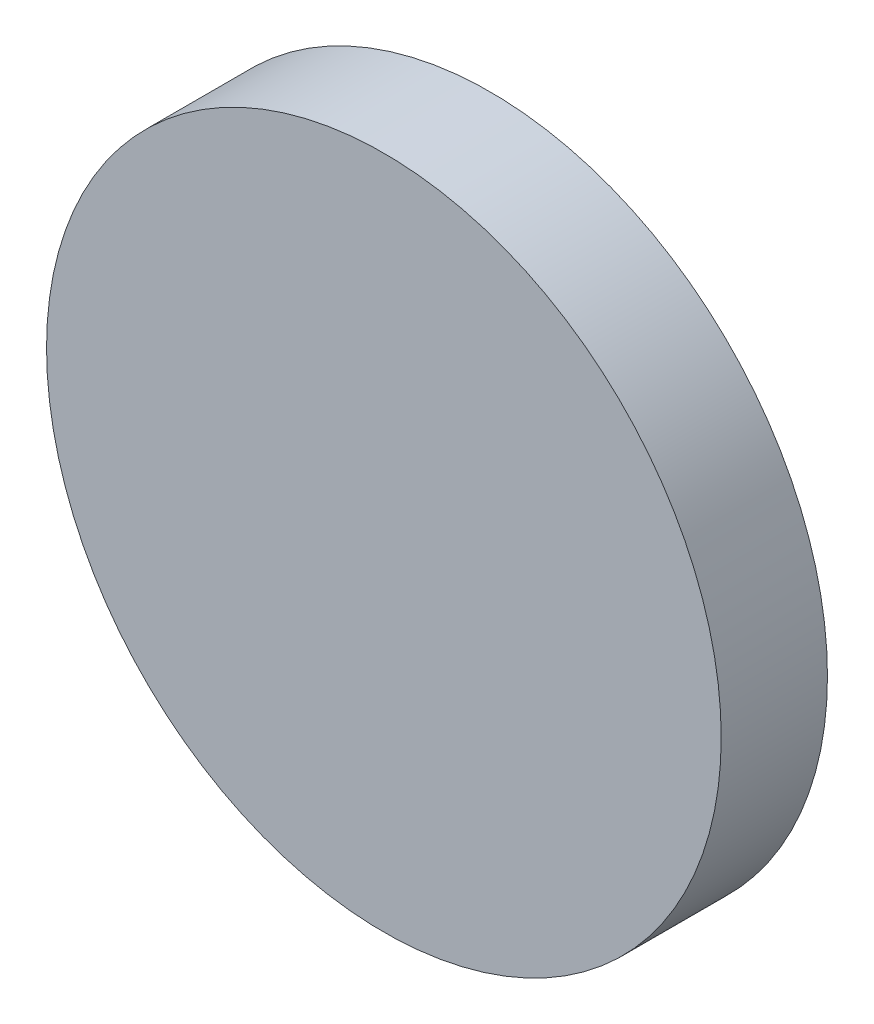
ISO-10303-21;
HEADER;
FILE_DESCRIPTION(('STEP AP214'),'2;1');
FILE_NAME('part.step','',(''),(''),'','','');
FILE_SCHEMA(('AUTOMOTIVE_DESIGN { 1 0 10303 214 1 1 1 1 }'));
ENDSEC;
DATA;
#1=APPLICATION_CONTEXT('core data for automotive mechanical design processes');
#2=APPLICATION_PROTOCOL_DEFINITION('international standard','automotive_design',2000,#1);
#3=PRODUCT_CONTEXT('',#1,'mechanical');
#4=PRODUCT('Part','Part','',(#3));
#5=PRODUCT_RELATED_PRODUCT_CATEGORY('part','',(#4));
#6=PRODUCT_DEFINITION_FORMATION('','',#4);
#7=PRODUCT_DEFINITION_CONTEXT('part definition',#1,'design');
#8=PRODUCT_DEFINITION('design','',#6,#7);
#9=PRODUCT_DEFINITION_SHAPE('','',#8);
#10=(LENGTH_UNIT() NAMED_UNIT(*) SI_UNIT(.MILLI.,.METRE.));
#11=(NAMED_UNIT(*) PLANE_ANGLE_UNIT() SI_UNIT($,.RADIAN.));
#12=(NAMED_UNIT(*) SI_UNIT($,.STERADIAN.) SOLID_ANGLE_UNIT());
#13=UNCERTAINTY_MEASURE_WITH_UNIT(LENGTH_MEASURE(1.E-05),#10,'distance_accuracy_value','');
#14=(GEOMETRIC_REPRESENTATION_CONTEXT(3) GLOBAL_UNCERTAINTY_ASSIGNED_CONTEXT((#13)) GLOBAL_UNIT_ASSIGNED_CONTEXT((#10,
#11,#12)) REPRESENTATION_CONTEXT('',''));
#15=CARTESIAN_POINT('',(0.,0.,0.));
#16=DIRECTION('',(0.,0.,1.));
#17=DIRECTION('',(1.,0.,0.));
#18=AXIS2_PLACEMENT_3D('',#15,#16,#17);
#19=CARTESIAN_POINT('',(0.,0.,2.));
#20=DIRECTION('',(0.,0.,-1.));
#21=DIRECTION('',(-1.,0.,0.));
#22=AXIS2_PLACEMENT_3D('',#19,#20,#21);
#23=CYLINDRICAL_SURFACE('',#22,6.35);
#24=CARTESIAN_POINT('',(0.,0.,2.));
#25=DIRECTION('',(0.,0.,1.));
#26=DIRECTION('',(1.,0.,0.));
#27=AXIS2_PLACEMENT_3D('',#24,#25,#26);
#28=CIRCLE('',#27,6.35);
#29=CARTESIAN_POINT('',(6.35,0.,2.));
#30=VERTEX_POINT('',#29);
#31=EDGE_CURVE('E10',#30,#30,#28,.T.);
#32=ORIENTED_EDGE('',*,*,#31,.F.);
#33=EDGE_LOOP('',(#32));
#34=FACE_BOUND('',#33,.T.);
#35=CARTESIAN_POINT('',(0.,0.,0.));
#36=DIRECTION('',(0.,0.,1.));
#37=DIRECTION('',(1.,0.,0.));
#38=AXIS2_PLACEMENT_3D('',#35,#36,#37);
#39=CIRCLE('',#38,6.35);
#40=CARTESIAN_POINT('',(6.35,0.,0.));
#41=VERTEX_POINT('',#40);
#42=EDGE_CURVE('E38',#41,#41,#39,.T.);
#43=ORIENTED_EDGE('',*,*,#42,.T.);
#44=EDGE_LOOP('',(#43));
#45=FACE_BOUND('',#44,.T.);
#46=ADVANCED_FACE('F35',(#34,#45),#23,.T.);
#47=CARTESIAN_POINT('',(0.,0.,2.));
#48=DIRECTION('',(0.,0.,1.));
#49=DIRECTION('',(1.,0.,0.));
#50=AXIS2_PLACEMENT_3D('',#47,#48,#49);
#51=PLANE('',#50);
#52=ORIENTED_EDGE('',*,*,#31,.T.);
#53=EDGE_LOOP('',(#52));
#54=FACE_BOUND('',#53,.T.);
#55=ADVANCED_FACE('F50',(#54),#51,.T.);
#56=CARTESIAN_POINT('',(0.,0.,0.));
#57=DIRECTION('',(0.,0.,1.));
#58=DIRECTION('',(1.,0.,0.));
#59=AXIS2_PLACEMENT_3D('',#56,#57,#58);
#60=PLANE('',#59);
#61=ORIENTED_EDGE('',*,*,#42,.F.);
#62=EDGE_LOOP('',(#61));
#63=FACE_BOUND('',#62,.T.);
#64=ADVANCED_FACE('F48',(#63),#60,.F.);
#65=CLOSED_SHELL('',(#46,#55,#64));
#66=MANIFOLD_SOLID_BREP('B2',#65);
#67=ADVANCED_BREP_SHAPE_REPRESENTATION('',(#18,#66),#14);
#68=SHAPE_DEFINITION_REPRESENTATION(#9,#67);
ENDSEC;
END-ISO-10303-21;
